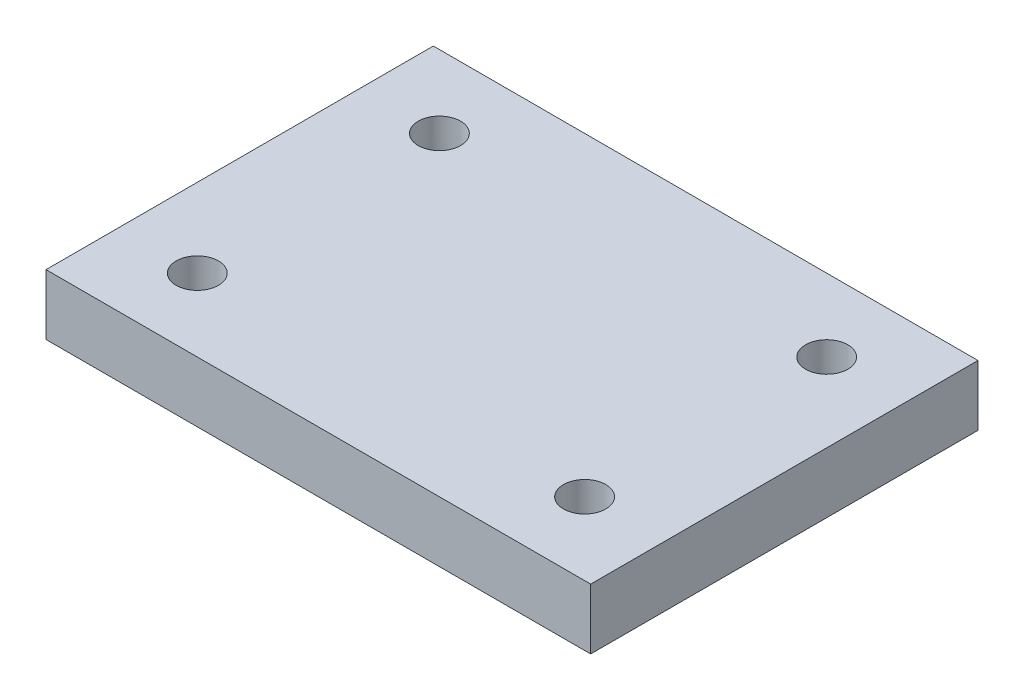
ISO-10303-21;
HEADER;
FILE_DESCRIPTION(('STEP AP214'),'2;1');
FILE_NAME('part.step','',(''),(''),'','','');
FILE_SCHEMA(('AUTOMOTIVE_DESIGN { 1 0 10303 214 1 1 1 1 }'));
ENDSEC;
DATA;
#1=APPLICATION_CONTEXT('core data for automotive mechanical design processes');
#2=APPLICATION_PROTOCOL_DEFINITION('international standard','automotive_design',2000,#1);
#3=PRODUCT_CONTEXT('',#1,'mechanical');
#4=PRODUCT('Part','Part','',(#3));
#5=PRODUCT_RELATED_PRODUCT_CATEGORY('part','',(#4));
#6=PRODUCT_DEFINITION_FORMATION('','',#4);
#7=PRODUCT_DEFINITION_CONTEXT('part definition',#1,'design');
#8=PRODUCT_DEFINITION('design','',#6,#7);
#9=PRODUCT_DEFINITION_SHAPE('','',#8);
#10=(LENGTH_UNIT() NAMED_UNIT(*) SI_UNIT(.MILLI.,.METRE.));
#11=(NAMED_UNIT(*) PLANE_ANGLE_UNIT() SI_UNIT($,.RADIAN.));
#12=(NAMED_UNIT(*) SI_UNIT($,.STERADIAN.) SOLID_ANGLE_UNIT());
#13=UNCERTAINTY_MEASURE_WITH_UNIT(LENGTH_MEASURE(1.E-05),#10,'distance_accuracy_value','');
#14=(GEOMETRIC_REPRESENTATION_CONTEXT(3) GLOBAL_UNCERTAINTY_ASSIGNED_CONTEXT((#13)) GLOBAL_UNIT_ASSIGNED_CONTEXT((#10,
#11,#12)) REPRESENTATION_CONTEXT('',''));
#15=CARTESIAN_POINT('',(0.,0.,0.));
#16=DIRECTION('',(0.,0.,1.));
#17=DIRECTION('',(1.,0.,0.));
#18=AXIS2_PLACEMENT_3D('',#15,#16,#17);
#19=CARTESIAN_POINT('',(0.,50.,0.));
#20=DIRECTION('',(0.,0.,-1.));
#21=DIRECTION('',(-1.,0.,0.));
#22=AXIS2_PLACEMENT_3D('',#19,#20,#21);
#23=PLANE('',#22);
#24=DIRECTION('',(1.,0.,0.));
#25=VECTOR('',#24,1.);
#26=CARTESIAN_POINT('',(0.,50.,0.));
#27=LINE('',#26,#25);
#28=CARTESIAN_POINT('',(5.,50.,0.));
#29=VERTEX_POINT('',#28);
#30=CARTESIAN_POINT('',(50.,50.,0.));
#31=VERTEX_POINT('',#30);
#32=EDGE_CURVE('E41',#29,#31,#27,.T.);
#33=ORIENTED_EDGE('',*,*,#32,.F.);
#34=DIRECTION('',(0.,1.,0.));
#35=VECTOR('',#34,1.);
#36=CARTESIAN_POINT('',(5.,0.,0.));
#37=LINE('',#36,#35);
#38=CARTESIAN_POINT('',(5.,45.,0.));
#39=VERTEX_POINT('',#38);
#40=EDGE_CURVE('E74',#39,#29,#37,.T.);
#41=ORIENTED_EDGE('',*,*,#40,.F.);
#42=DIRECTION('',(-1.,0.,0.));
#43=VECTOR('',#42,1.);
#44=CARTESIAN_POINT('',(5.,45.,0.));
#45=LINE('',#44,#43);
#46=CARTESIAN_POINT('',(50.,45.,0.));
#47=VERTEX_POINT('',#46);
#48=EDGE_CURVE('E91',#47,#39,#45,.T.);
#49=ORIENTED_EDGE('',*,*,#48,.F.);
#50=DIRECTION('',(0.,1.,0.));
#51=VECTOR('',#50,1.);
#52=CARTESIAN_POINT('',(50.,0.,0.));
#53=LINE('',#52,#51);
#54=EDGE_CURVE('E90',#47,#31,#53,.T.);
#55=ORIENTED_EDGE('',*,*,#54,.T.);
#56=EDGE_LOOP('',(#33,#41,#49,#55));
#57=FACE_BOUND('',#56,.T.);
#58=ADVANCED_FACE('F33',(#57),#23,.F.);
#59=CARTESIAN_POINT('',(0.,50.,-32.));
#60=DIRECTION('',(0.,0.,1.));
#61=DIRECTION('',(1.,0.,0.));
#62=AXIS2_PLACEMENT_3D('',#59,#60,#61);
#63=PLANE('',#62);
#64=DIRECTION('',(1.,0.,0.));
#65=VECTOR('',#64,1.);
#66=CARTESIAN_POINT('',(5.,45.,-32.));
#67=LINE('',#66,#65);
#68=CARTESIAN_POINT('',(5.,45.,-32.));
#69=VERTEX_POINT('',#68);
#70=CARTESIAN_POINT('',(50.,45.,-32.));
#71=VERTEX_POINT('',#70);
#72=EDGE_CURVE('E119',#69,#71,#67,.T.);
#73=ORIENTED_EDGE('',*,*,#72,.F.);
#74=DIRECTION('',(0.,1.,0.));
#75=VECTOR('',#74,1.);
#76=CARTESIAN_POINT('',(5.,0.,-32.));
#77=LINE('',#76,#75);
#78=CARTESIAN_POINT('',(5.,50.,-32.));
#79=VERTEX_POINT('',#78);
#80=EDGE_CURVE('E49',#69,#79,#77,.T.);
#81=ORIENTED_EDGE('',*,*,#80,.T.);
#82=DIRECTION('',(-1.,0.,0.));
#83=VECTOR('',#82,1.);
#84=CARTESIAN_POINT('',(0.,50.,-32.));
#85=LINE('',#84,#83);
#86=CARTESIAN_POINT('',(50.,50.,-32.));
#87=VERTEX_POINT('',#86);
#88=EDGE_CURVE('E11',#87,#79,#85,.T.);
#89=ORIENTED_EDGE('',*,*,#88,.F.);
#90=DIRECTION('',(0.,1.,0.));
#91=VECTOR('',#90,1.);
#92=CARTESIAN_POINT('',(50.,0.,-32.));
#93=LINE('',#92,#91);
#94=EDGE_CURVE('E126',#71,#87,#93,.T.);
#95=ORIENTED_EDGE('',*,*,#94,.F.);
#96=EDGE_LOOP('',(#73,#81,#89,#95));
#97=FACE_BOUND('',#96,.T.);
#98=ADVANCED_FACE('F125',(#97),#63,.F.);
#99=CARTESIAN_POINT('',(0.,50.,0.));
#100=DIRECTION('',(0.,-1.,0.));
#101=DIRECTION('',(0.,0.,-1.));
#102=AXIS2_PLACEMENT_3D('',#99,#100,#101);
#103=PLANE('',#102);
#104=CARTESIAN_POINT('',(43.5,50.,-6.));
#105=DIRECTION('',(0.,1.,0.));
#106=DIRECTION('',(0.,0.,1.));
#107=AXIS2_PLACEMENT_3D('',#104,#105,#106);
#108=CIRCLE('',#107,1.75);
#109=CARTESIAN_POINT('',(43.5,50.,-4.25000000000001));
#110=VERTEX_POINT('',#109);
#111=EDGE_CURVE('E103',#110,#110,#108,.T.);
#112=ORIENTED_EDGE('',*,*,#111,.F.);
#113=EDGE_LOOP('',(#112));
#114=FACE_BOUND('',#113,.T.);
#115=CARTESIAN_POINT('',(11.5,50.,-26.));
#116=DIRECTION('',(0.,1.,0.));
#117=DIRECTION('',(0.,0.,1.));
#118=AXIS2_PLACEMENT_3D('',#115,#116,#117);
#119=CIRCLE('',#118,1.75);
#120=CARTESIAN_POINT('',(11.5,50.,-24.25));
#121=VERTEX_POINT('',#120);
#122=EDGE_CURVE('E134',#121,#121,#119,.T.);
#123=ORIENTED_EDGE('',*,*,#122,.F.);
#124=EDGE_LOOP('',(#123));
#125=FACE_BOUND('',#124,.T.);
#126=CARTESIAN_POINT('',(11.5,50.,-6.));
#127=DIRECTION('',(0.,1.,0.));
#128=DIRECTION('',(0.,0.,1.));
#129=AXIS2_PLACEMENT_3D('',#126,#127,#128);
#130=CIRCLE('',#129,1.75);
#131=CARTESIAN_POINT('',(11.5,50.,-4.25000000000001));
#132=VERTEX_POINT('',#131);
#133=EDGE_CURVE('E116',#132,#132,#130,.T.);
#134=ORIENTED_EDGE('',*,*,#133,.F.);
#135=EDGE_LOOP('',(#134));
#136=FACE_BOUND('',#135,.T.);
#137=CARTESIAN_POINT('',(43.5,50.,-26.));
#138=DIRECTION('',(0.,1.,0.));
#139=DIRECTION('',(0.,0.,1.));
#140=AXIS2_PLACEMENT_3D('',#137,#138,#139);
#141=CIRCLE('',#140,1.75);
#142=CARTESIAN_POINT('',(43.5,50.,-24.25));
#143=VERTEX_POINT('',#142);
#144=EDGE_CURVE('E99',#143,#143,#141,.T.);
#145=ORIENTED_EDGE('',*,*,#144,.F.);
#146=EDGE_LOOP('',(#145));
#147=FACE_BOUND('',#146,.T.);
#148=ORIENTED_EDGE('',*,*,#88,.T.);
#149=DIRECTION('',(0.,0.,-1.));
#150=VECTOR('',#149,1.);
#151=CARTESIAN_POINT('',(5.,50.,-32.));
#152=LINE('',#151,#150);
#153=EDGE_CURVE('E77',#29,#79,#152,.T.);
#154=ORIENTED_EDGE('',*,*,#153,.F.);
#155=ORIENTED_EDGE('',*,*,#32,.T.);
#156=DIRECTION('',(0.,0.,1.));
#157=VECTOR('',#156,1.);
#158=CARTESIAN_POINT('',(50.,50.,-32.));
#159=LINE('',#158,#157);
#160=EDGE_CURVE('E128',#87,#31,#159,.T.);
#161=ORIENTED_EDGE('',*,*,#160,.F.);
#162=EDGE_LOOP('',(#148,#154,#155,#161));
#163=FACE_BOUND('',#162,.T.);
#164=ADVANCED_FACE('F84',(#114,#125,#136,#147,#163),#103,.F.);
#165=CARTESIAN_POINT('',(0.,45.,0.));
#166=DIRECTION('',(0.,-1.,0.));
#167=DIRECTION('',(0.,0.,-1.));
#168=AXIS2_PLACEMENT_3D('',#165,#166,#167);
#169=PLANE('',#168);
#170=DIRECTION('',(0.,0.,1.));
#171=VECTOR('',#170,1.);
#172=CARTESIAN_POINT('',(50.,45.,0.));
#173=LINE('',#172,#171);
#174=EDGE_CURVE('E57',#71,#47,#173,.T.);
#175=ORIENTED_EDGE('',*,*,#174,.T.);
#176=ORIENTED_EDGE('',*,*,#48,.T.);
#177=DIRECTION('',(0.,0.,-1.));
#178=VECTOR('',#177,1.);
#179=CARTESIAN_POINT('',(5.,45.,0.));
#180=LINE('',#179,#178);
#181=EDGE_CURVE('E78',#39,#69,#180,.T.);
#182=ORIENTED_EDGE('',*,*,#181,.T.);
#183=ORIENTED_EDGE('',*,*,#72,.T.);
#184=EDGE_LOOP('',(#175,#176,#182,#183));
#185=FACE_BOUND('',#184,.T.);
#186=CARTESIAN_POINT('',(43.5,45.,-6.));
#187=DIRECTION('',(0.,-1.,0.));
#188=DIRECTION('',(0.,0.,-1.));
#189=AXIS2_PLACEMENT_3D('',#186,#187,#188);
#190=CIRCLE('',#189,1.75);
#191=CARTESIAN_POINT('',(43.5,45.,-7.75));
#192=VERTEX_POINT('',#191);
#193=EDGE_CURVE('E36',#192,#192,#190,.T.);
#194=ORIENTED_EDGE('',*,*,#193,.F.);
#195=EDGE_LOOP('',(#194));
#196=FACE_BOUND('',#195,.T.);
#197=CARTESIAN_POINT('',(11.5,45.,-26.));
#198=DIRECTION('',(0.,-1.,0.));
#199=DIRECTION('',(0.,0.,-1.));
#200=AXIS2_PLACEMENT_3D('',#197,#198,#199);
#201=CIRCLE('',#200,1.75);
#202=CARTESIAN_POINT('',(11.5,45.,-27.75));
#203=VERTEX_POINT('',#202);
#204=EDGE_CURVE('E102',#203,#203,#201,.T.);
#205=ORIENTED_EDGE('',*,*,#204,.F.);
#206=EDGE_LOOP('',(#205));
#207=FACE_BOUND('',#206,.T.);
#208=CARTESIAN_POINT('',(11.5,45.,-6.));
#209=DIRECTION('',(0.,-1.,0.));
#210=DIRECTION('',(0.,0.,-1.));
#211=AXIS2_PLACEMENT_3D('',#208,#209,#210);
#212=CIRCLE('',#211,1.75);
#213=CARTESIAN_POINT('',(11.5,45.,-7.75));
#214=VERTEX_POINT('',#213);
#215=EDGE_CURVE('E100',#214,#214,#212,.T.);
#216=ORIENTED_EDGE('',*,*,#215,.F.);
#217=EDGE_LOOP('',(#216));
#218=FACE_BOUND('',#217,.T.);
#219=CARTESIAN_POINT('',(43.5,45.,-26.));
#220=DIRECTION('',(0.,-1.,0.));
#221=DIRECTION('',(0.,0.,-1.));
#222=AXIS2_PLACEMENT_3D('',#219,#220,#221);
#223=CIRCLE('',#222,1.75);
#224=CARTESIAN_POINT('',(43.5,45.,-27.75));
#225=VERTEX_POINT('',#224);
#226=EDGE_CURVE('E96',#225,#225,#223,.T.);
#227=ORIENTED_EDGE('',*,*,#226,.F.);
#228=EDGE_LOOP('',(#227));
#229=FACE_BOUND('',#228,.T.);
#230=ADVANCED_FACE('F121',(#185,#196,#207,#218,#229),#169,.T.);
#231=CARTESIAN_POINT('',(43.5,0.,-26.));
#232=DIRECTION('',(0.,1.,0.));
#233=DIRECTION('',(0.,0.,1.));
#234=AXIS2_PLACEMENT_3D('',#231,#232,#233);
#235=CYLINDRICAL_SURFACE('',#234,1.75);
#236=ORIENTED_EDGE('',*,*,#226,.T.);
#237=EDGE_LOOP('',(#236));
#238=FACE_BOUND('',#237,.T.);
#239=ORIENTED_EDGE('',*,*,#144,.T.);
#240=EDGE_LOOP('',(#239));
#241=FACE_BOUND('',#240,.T.);
#242=ADVANCED_FACE('F151',(#238,#241),#235,.F.);
#243=CARTESIAN_POINT('',(11.5,0.,-6.));
#244=DIRECTION('',(0.,1.,0.));
#245=DIRECTION('',(0.,0.,1.));
#246=AXIS2_PLACEMENT_3D('',#243,#244,#245);
#247=CYLINDRICAL_SURFACE('',#246,1.75);
#248=ORIENTED_EDGE('',*,*,#215,.T.);
#249=EDGE_LOOP('',(#248));
#250=FACE_BOUND('',#249,.T.);
#251=ORIENTED_EDGE('',*,*,#133,.T.);
#252=EDGE_LOOP('',(#251));
#253=FACE_BOUND('',#252,.T.);
#254=ADVANCED_FACE('F141',(#250,#253),#247,.F.);
#255=CARTESIAN_POINT('',(11.5,0.,-26.));
#256=DIRECTION('',(0.,1.,0.));
#257=DIRECTION('',(0.,0.,1.));
#258=AXIS2_PLACEMENT_3D('',#255,#256,#257);
#259=CYLINDRICAL_SURFACE('',#258,1.75);
#260=ORIENTED_EDGE('',*,*,#204,.T.);
#261=EDGE_LOOP('',(#260));
#262=FACE_BOUND('',#261,.T.);
#263=ORIENTED_EDGE('',*,*,#122,.T.);
#264=EDGE_LOOP('',(#263));
#265=FACE_BOUND('',#264,.T.);
#266=ADVANCED_FACE('F197',(#262,#265),#259,.F.);
#267=CARTESIAN_POINT('',(43.5,0.,-6.));
#268=DIRECTION('',(0.,1.,0.));
#269=DIRECTION('',(0.,0.,1.));
#270=AXIS2_PLACEMENT_3D('',#267,#268,#269);
#271=CYLINDRICAL_SURFACE('',#270,1.75);
#272=ORIENTED_EDGE('',*,*,#193,.T.);
#273=EDGE_LOOP('',(#272));
#274=FACE_BOUND('',#273,.T.);
#275=ORIENTED_EDGE('',*,*,#111,.T.);
#276=EDGE_LOOP('',(#275));
#277=FACE_BOUND('',#276,.T.);
#278=ADVANCED_FACE('F162',(#274,#277),#271,.F.);
#279=CARTESIAN_POINT('',(50.,0.,-32.));
#280=DIRECTION('',(-1.,0.,0.));
#281=DIRECTION('',(0.,0.,1.));
#282=AXIS2_PLACEMENT_3D('',#279,#280,#281);
#283=PLANE('',#282);
#284=ORIENTED_EDGE('',*,*,#54,.F.);
#285=ORIENTED_EDGE('',*,*,#174,.F.);
#286=ORIENTED_EDGE('',*,*,#94,.T.);
#287=ORIENTED_EDGE('',*,*,#160,.T.);
#288=EDGE_LOOP('',(#284,#285,#286,#287));
#289=FACE_BOUND('',#288,.T.);
#290=ADVANCED_FACE('F208',(#289),#283,.F.);
#291=CARTESIAN_POINT('',(5.,0.,-32.));
#292=DIRECTION('',(1.,0.,0.));
#293=DIRECTION('',(0.,0.,-1.));
#294=AXIS2_PLACEMENT_3D('',#291,#292,#293);
#295=PLANE('',#294);
#296=ORIENTED_EDGE('',*,*,#181,.F.);
#297=ORIENTED_EDGE('',*,*,#40,.T.);
#298=ORIENTED_EDGE('',*,*,#153,.T.);
#299=ORIENTED_EDGE('',*,*,#80,.F.);
#300=EDGE_LOOP('',(#296,#297,#298,#299));
#301=FACE_BOUND('',#300,.T.);
#302=ADVANCED_FACE('F76',(#301),#295,.F.);
#303=CLOSED_SHELL('',(#58,#98,#164,#230,#242,#254,#266,#278,#290,#302));
#304=MANIFOLD_SOLID_BREP('B2',#303);
#305=ADVANCED_BREP_SHAPE_REPRESENTATION('',(#18,#304),#14);
#306=SHAPE_DEFINITION_REPRESENTATION(#9,#305);
ENDSEC;
END-ISO-10303-21;
